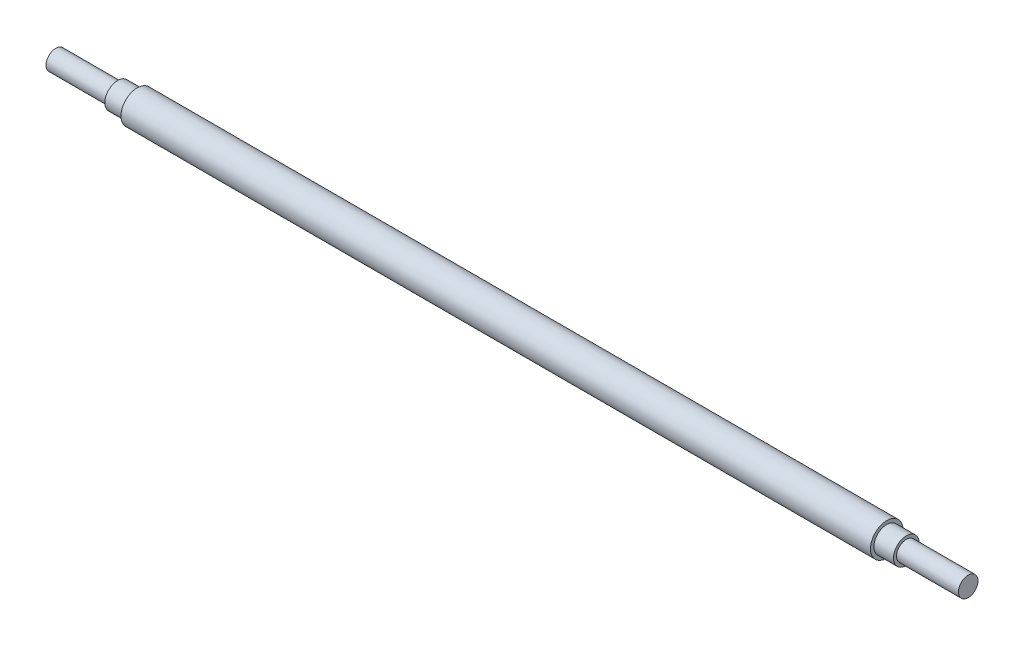
ISO-10303-21;
HEADER;
FILE_DESCRIPTION(('STEP AP214'),'2;1');
FILE_NAME('part.step','',(''),(''),'','','');
FILE_SCHEMA(('AUTOMOTIVE_DESIGN { 1 0 10303 214 1 1 1 1 }'));
ENDSEC;
DATA;
#1=APPLICATION_CONTEXT('core data for automotive mechanical design processes');
#2=APPLICATION_PROTOCOL_DEFINITION('international standard','automotive_design',2000,#1);
#3=PRODUCT_CONTEXT('',#1,'mechanical');
#4=PRODUCT('Part','Part','',(#3));
#5=PRODUCT_RELATED_PRODUCT_CATEGORY('part','',(#4));
#6=PRODUCT_DEFINITION_FORMATION('','',#4);
#7=PRODUCT_DEFINITION_CONTEXT('part definition',#1,'design');
#8=PRODUCT_DEFINITION('design','',#6,#7);
#9=PRODUCT_DEFINITION_SHAPE('','',#8);
#10=(LENGTH_UNIT() NAMED_UNIT(*) SI_UNIT(.MILLI.,.METRE.));
#11=(NAMED_UNIT(*) PLANE_ANGLE_UNIT() SI_UNIT($,.RADIAN.));
#12=(NAMED_UNIT(*) SI_UNIT($,.STERADIAN.) SOLID_ANGLE_UNIT());
#13=UNCERTAINTY_MEASURE_WITH_UNIT(LENGTH_MEASURE(1.E-05),#10,'distance_accuracy_value','');
#14=(GEOMETRIC_REPRESENTATION_CONTEXT(3) GLOBAL_UNCERTAINTY_ASSIGNED_CONTEXT((#13)) GLOBAL_UNIT_ASSIGNED_CONTEXT((#10,
#11,#12)) REPRESENTATION_CONTEXT('',''));
#15=CARTESIAN_POINT('',(0.,0.,0.));
#16=DIRECTION('',(0.,0.,1.));
#17=DIRECTION('',(1.,0.,0.));
#18=AXIS2_PLACEMENT_3D('',#15,#16,#17);
#19=CARTESIAN_POINT('',(-27.3626373626374,3.,0.));
#20=DIRECTION('',(1.,0.,0.));
#21=DIRECTION('',(0.,0.,-1.));
#22=AXIS2_PLACEMENT_3D('',#19,#20,#21);
#23=PLANE('',#22);
#24=CARTESIAN_POINT('',(-27.3626373626374,0.,0.));
#25=DIRECTION('',(-1.,0.,0.));
#26=DIRECTION('',(0.,0.,1.));
#27=AXIS2_PLACEMENT_3D('',#24,#25,#26);
#28=CIRCLE('',#27,3.);
#29=CARTESIAN_POINT('',(-27.3626373626374,0.,3.));
#30=VERTEX_POINT('',#29);
#31=EDGE_CURVE('E64',#30,#30,#28,.T.);
#32=ORIENTED_EDGE('',*,*,#31,.T.);
#33=EDGE_LOOP('',(#32));
#34=FACE_BOUND('',#33,.T.);
#35=ADVANCED_FACE('F30',(#34),#23,.F.);
#36=CARTESIAN_POINT('',(252.637362637363,0.,0.));
#37=DIRECTION('',(-1.,0.,0.));
#38=DIRECTION('',(0.,0.,1.));
#39=AXIS2_PLACEMENT_3D('',#36,#37,#38);
#40=PLANE('',#39);
#41=CARTESIAN_POINT('',(252.637362637363,0.,0.));
#42=DIRECTION('',(-1.,0.,0.));
#43=DIRECTION('',(0.,0.,1.));
#44=AXIS2_PLACEMENT_3D('',#41,#42,#43);
#45=CIRCLE('',#44,3.0000000000001);
#46=CARTESIAN_POINT('',(252.637362637363,0.,3.0000000000001));
#47=VERTEX_POINT('',#46);
#48=EDGE_CURVE('E10',#47,#47,#45,.T.);
#49=ORIENTED_EDGE('',*,*,#48,.F.);
#50=EDGE_LOOP('',(#49));
#51=FACE_BOUND('',#50,.T.);
#52=ADVANCED_FACE('F118',(#51),#40,.F.);
#53=CARTESIAN_POINT('',(-47.9120879120879,0.,0.));
#54=DIRECTION('',(-1.,0.,0.));
#55=DIRECTION('',(0.,0.,1.));
#56=AXIS2_PLACEMENT_3D('',#53,#54,#55);
#57=CYLINDRICAL_SURFACE('',#56,3.0000000000001);
#58=CARTESIAN_POINT('',(233.637362637363,0.,0.));
#59=DIRECTION('',(-1.,0.,0.));
#60=DIRECTION('',(0.,0.,1.));
#61=AXIS2_PLACEMENT_3D('',#58,#59,#60);
#62=CIRCLE('',#61,3.00000000000009);
#63=CARTESIAN_POINT('',(233.637362637363,0.,3.00000000000009));
#64=VERTEX_POINT('',#63);
#65=EDGE_CURVE('E36',#64,#64,#62,.T.);
#66=ORIENTED_EDGE('',*,*,#65,.F.);
#67=EDGE_LOOP('',(#66));
#68=FACE_BOUND('',#67,.T.);
#69=ORIENTED_EDGE('',*,*,#48,.T.);
#70=EDGE_LOOP('',(#69));
#71=FACE_BOUND('',#70,.T.);
#72=ADVANCED_FACE('F113',(#68,#71),#57,.T.);
#73=CARTESIAN_POINT('',(233.637362637363,3.00000000000009,0.));
#74=DIRECTION('',(-1.,0.,0.));
#75=DIRECTION('',(0.,0.,1.));
#76=AXIS2_PLACEMENT_3D('',#73,#74,#75);
#77=PLANE('',#76);
#78=CARTESIAN_POINT('',(233.637362637363,0.,0.));
#79=DIRECTION('',(-1.,0.,0.));
#80=DIRECTION('',(0.,0.,1.));
#81=AXIS2_PLACEMENT_3D('',#78,#79,#80);
#82=CIRCLE('',#81,3.95000000000009);
#83=CARTESIAN_POINT('',(233.637362637363,0.,3.95000000000009));
#84=VERTEX_POINT('',#83);
#85=EDGE_CURVE('E40',#84,#84,#82,.T.);
#86=ORIENTED_EDGE('',*,*,#85,.F.);
#87=EDGE_LOOP('',(#86));
#88=FACE_BOUND('',#87,.T.);
#89=ORIENTED_EDGE('',*,*,#65,.T.);
#90=EDGE_LOOP('',(#89));
#91=FACE_BOUND('',#90,.T.);
#92=ADVANCED_FACE('F108',(#88,#91),#77,.F.);
#93=CARTESIAN_POINT('',(-47.9120879120879,0.,0.));
#94=DIRECTION('',(-1.,0.,0.));
#95=DIRECTION('',(0.,0.,1.));
#96=AXIS2_PLACEMENT_3D('',#93,#94,#95);
#97=CYLINDRICAL_SURFACE('',#96,3.95000000000009);
#98=CARTESIAN_POINT('',(227.637362637363,0.,0.));
#99=DIRECTION('',(-1.,0.,0.));
#100=DIRECTION('',(0.,0.,1.));
#101=AXIS2_PLACEMENT_3D('',#98,#99,#100);
#102=CIRCLE('',#101,3.95000000000009);
#103=CARTESIAN_POINT('',(227.637362637363,0.,3.95000000000009));
#104=VERTEX_POINT('',#103);
#105=EDGE_CURVE('E44',#104,#104,#102,.T.);
#106=ORIENTED_EDGE('',*,*,#105,.F.);
#107=EDGE_LOOP('',(#106));
#108=FACE_BOUND('',#107,.T.);
#109=ORIENTED_EDGE('',*,*,#85,.T.);
#110=EDGE_LOOP('',(#109));
#111=FACE_BOUND('',#110,.T.);
#112=ADVANCED_FACE('F102',(#108,#111),#97,.T.);
#113=CARTESIAN_POINT('',(227.637362637363,3.95000000000009,0.));
#114=DIRECTION('',(-1.,0.,0.));
#115=DIRECTION('',(0.,0.,1.));
#116=AXIS2_PLACEMENT_3D('',#113,#114,#115);
#117=PLANE('',#116);
#118=CARTESIAN_POINT('',(227.637362637363,0.,0.));
#119=DIRECTION('',(-1.,0.,0.));
#120=DIRECTION('',(0.,0.,1.));
#121=AXIS2_PLACEMENT_3D('',#118,#119,#120);
#122=CIRCLE('',#121,5.00000000000006);
#123=CARTESIAN_POINT('',(227.637362637363,0.,5.00000000000006));
#124=VERTEX_POINT('',#123);
#125=EDGE_CURVE('E49',#124,#124,#122,.T.);
#126=ORIENTED_EDGE('',*,*,#125,.F.);
#127=EDGE_LOOP('',(#126));
#128=FACE_BOUND('',#127,.T.);
#129=ORIENTED_EDGE('',*,*,#105,.T.);
#130=EDGE_LOOP('',(#129));
#131=FACE_BOUND('',#130,.T.);
#132=ADVANCED_FACE('F96',(#128,#131),#117,.F.);
#133=CARTESIAN_POINT('',(-47.9120879120879,0.,0.));
#134=DIRECTION('',(-1.,0.,0.));
#135=DIRECTION('',(0.,0.,1.));
#136=AXIS2_PLACEMENT_3D('',#133,#134,#135);
#137=CYLINDRICAL_SURFACE('',#136,5.00000000000005);
#138=CARTESIAN_POINT('',(-2.36263736263736,0.,0.));
#139=DIRECTION('',(-1.,0.,0.));
#140=DIRECTION('',(0.,0.,1.));
#141=AXIS2_PLACEMENT_3D('',#138,#139,#140);
#142=CIRCLE('',#141,5.00000000000003);
#143=CARTESIAN_POINT('',(-2.36263736263736,0.,5.00000000000003));
#144=VERTEX_POINT('',#143);
#145=EDGE_CURVE('E52',#144,#144,#142,.T.);
#146=ORIENTED_EDGE('',*,*,#145,.F.);
#147=EDGE_LOOP('',(#146));
#148=FACE_BOUND('',#147,.T.);
#149=ORIENTED_EDGE('',*,*,#125,.T.);
#150=EDGE_LOOP('',(#149));
#151=FACE_BOUND('',#150,.T.);
#152=ADVANCED_FACE('F90',(#148,#151),#137,.T.);
#153=CARTESIAN_POINT('',(-2.36263736263736,5.00000000000003,0.));
#154=DIRECTION('',(1.,0.,0.));
#155=DIRECTION('',(0.,0.,-1.));
#156=AXIS2_PLACEMENT_3D('',#153,#154,#155);
#157=PLANE('',#156);
#158=CARTESIAN_POINT('',(-2.36263736263736,0.,0.));
#159=DIRECTION('',(-1.,0.,0.));
#160=DIRECTION('',(0.,0.,1.));
#161=AXIS2_PLACEMENT_3D('',#158,#159,#160);
#162=CIRCLE('',#161,3.95000000000001);
#163=CARTESIAN_POINT('',(-2.36263736263736,0.,3.95000000000001));
#164=VERTEX_POINT('',#163);
#165=EDGE_CURVE('E55',#164,#164,#162,.T.);
#166=ORIENTED_EDGE('',*,*,#165,.F.);
#167=EDGE_LOOP('',(#166));
#168=FACE_BOUND('',#167,.T.);
#169=ORIENTED_EDGE('',*,*,#145,.T.);
#170=EDGE_LOOP('',(#169));
#171=FACE_BOUND('',#170,.T.);
#172=ADVANCED_FACE('F84',(#168,#171),#157,.F.);
#173=CARTESIAN_POINT('',(-47.9120879120879,0.,0.));
#174=DIRECTION('',(-1.,0.,0.));
#175=DIRECTION('',(0.,0.,1.));
#176=AXIS2_PLACEMENT_3D('',#173,#174,#175);
#177=CYLINDRICAL_SURFACE('',#176,3.95000000000001);
#178=CARTESIAN_POINT('',(-8.36263736263736,0.,0.));
#179=DIRECTION('',(-1.,0.,0.));
#180=DIRECTION('',(0.,0.,1.));
#181=AXIS2_PLACEMENT_3D('',#178,#179,#180);
#182=CIRCLE('',#181,3.95);
#183=CARTESIAN_POINT('',(-8.36263736263736,0.,3.95));
#184=VERTEX_POINT('',#183);
#185=EDGE_CURVE('E58',#184,#184,#182,.T.);
#186=ORIENTED_EDGE('',*,*,#185,.F.);
#187=EDGE_LOOP('',(#186));
#188=FACE_BOUND('',#187,.T.);
#189=ORIENTED_EDGE('',*,*,#165,.T.);
#190=EDGE_LOOP('',(#189));
#191=FACE_BOUND('',#190,.T.);
#192=ADVANCED_FACE('F78',(#188,#191),#177,.T.);
#193=CARTESIAN_POINT('',(-8.36263736263736,3.95,0.));
#194=DIRECTION('',(1.,0.,0.));
#195=DIRECTION('',(0.,0.,-1.));
#196=AXIS2_PLACEMENT_3D('',#193,#194,#195);
#197=PLANE('',#196);
#198=CARTESIAN_POINT('',(-8.36263736263736,0.,0.));
#199=DIRECTION('',(-1.,0.,0.));
#200=DIRECTION('',(0.,0.,1.));
#201=AXIS2_PLACEMENT_3D('',#198,#199,#200);
#202=CIRCLE('',#201,3.);
#203=CARTESIAN_POINT('',(-8.36263736263736,0.,3.));
#204=VERTEX_POINT('',#203);
#205=EDGE_CURVE('E61',#204,#204,#202,.T.);
#206=ORIENTED_EDGE('',*,*,#205,.F.);
#207=EDGE_LOOP('',(#206));
#208=FACE_BOUND('',#207,.T.);
#209=ORIENTED_EDGE('',*,*,#185,.T.);
#210=EDGE_LOOP('',(#209));
#211=FACE_BOUND('',#210,.T.);
#212=ADVANCED_FACE('F72',(#208,#211),#197,.F.);
#213=CARTESIAN_POINT('',(-47.9120879120879,0.,0.));
#214=DIRECTION('',(-1.,0.,0.));
#215=DIRECTION('',(0.,0.,1.));
#216=AXIS2_PLACEMENT_3D('',#213,#214,#215);
#217=CYLINDRICAL_SURFACE('',#216,3.);
#218=ORIENTED_EDGE('',*,*,#31,.F.);
#219=EDGE_LOOP('',(#218));
#220=FACE_BOUND('',#219,.T.);
#221=ORIENTED_EDGE('',*,*,#205,.T.);
#222=EDGE_LOOP('',(#221));
#223=FACE_BOUND('',#222,.T.);
#224=ADVANCED_FACE('F69',(#220,#223),#217,.T.);
#225=CLOSED_SHELL('',(#35,#52,#72,#92,#112,#132,#152,#172,#192,#212,#224));
#226=MANIFOLD_SOLID_BREP('B2',#225);
#227=ADVANCED_BREP_SHAPE_REPRESENTATION('',(#18,#226),#14);
#228=SHAPE_DEFINITION_REPRESENTATION(#9,#227);
ENDSEC;
END-ISO-10303-21;
